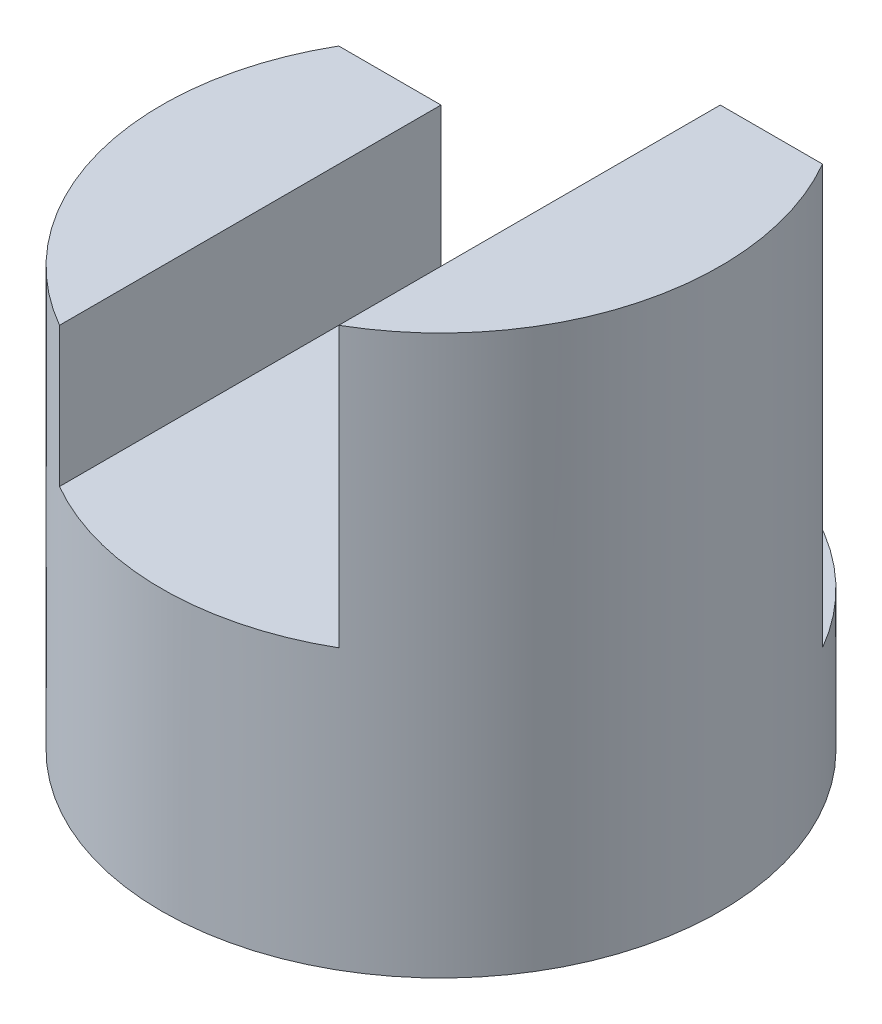
ISO-10303-21;
HEADER;
FILE_DESCRIPTION(('STEP AP214'),'2;1');
FILE_NAME('part.step','',(''),(''),'','','');
FILE_SCHEMA(('AUTOMOTIVE_DESIGN { 1 0 10303 214 1 1 1 1 }'));
ENDSEC;
DATA;
#1=APPLICATION_CONTEXT('core data for automotive mechanical design processes');
#2=APPLICATION_PROTOCOL_DEFINITION('international standard','automotive_design',2000,#1);
#3=PRODUCT_CONTEXT('',#1,'mechanical');
#4=PRODUCT('Part','Part','',(#3));
#5=PRODUCT_RELATED_PRODUCT_CATEGORY('part','',(#4));
#6=PRODUCT_DEFINITION_FORMATION('','',#4);
#7=PRODUCT_DEFINITION_CONTEXT('part definition',#1,'design');
#8=PRODUCT_DEFINITION('design','',#6,#7);
#9=PRODUCT_DEFINITION_SHAPE('','',#8);
#10=(LENGTH_UNIT() NAMED_UNIT(*) SI_UNIT(.MILLI.,.METRE.));
#11=(NAMED_UNIT(*) PLANE_ANGLE_UNIT() SI_UNIT($,.RADIAN.));
#12=(NAMED_UNIT(*) SI_UNIT($,.STERADIAN.) SOLID_ANGLE_UNIT());
#13=UNCERTAINTY_MEASURE_WITH_UNIT(LENGTH_MEASURE(1.E-05),#10,'distance_accuracy_value','');
#14=(GEOMETRIC_REPRESENTATION_CONTEXT(3) GLOBAL_UNCERTAINTY_ASSIGNED_CONTEXT((#13)) GLOBAL_UNIT_ASSIGNED_CONTEXT((#10,
#11,#12)) REPRESENTATION_CONTEXT('',''));
#15=CARTESIAN_POINT('',(0.,0.,0.));
#16=DIRECTION('',(0.,0.,1.));
#17=DIRECTION('',(1.,0.,0.));
#18=AXIS2_PLACEMENT_3D('',#15,#16,#17);
#19=CARTESIAN_POINT('',(0.,4.,0.));
#20=DIRECTION('',(0.,-1.,0.));
#21=DIRECTION('',(0.,0.,-1.));
#22=AXIS2_PLACEMENT_3D('',#19,#20,#21);
#23=CYLINDRICAL_SURFACE('',#22,2.);
#24=CARTESIAN_POINT('',(0.,4.,0.));
#25=DIRECTION('',(0.,1.,0.));
#26=DIRECTION('',(0.,0.,1.));
#27=AXIS2_PLACEMENT_3D('',#24,#25,#26);
#28=CIRCLE('',#27,2.);
#29=CARTESIAN_POINT('',(1.,4.,1.73205080756888));
#30=VERTEX_POINT('',#29);
#31=CARTESIAN_POINT('',(1.73205080756888,4.,-1.));
#32=VERTEX_POINT('',#31);
#33=EDGE_CURVE('E68',#30,#32,#28,.T.);
#34=ORIENTED_EDGE('',*,*,#33,.F.);
#35=DIRECTION('',(0.,-1.,0.));
#36=VECTOR('',#35,1.);
#37=CARTESIAN_POINT('',(1.,4.,1.73205080756888));
#38=LINE('',#37,#36);
#39=CARTESIAN_POINT('',(1.,2.,1.73205080756888));
#40=VERTEX_POINT('',#39);
#41=EDGE_CURVE('E75',#30,#40,#38,.T.);
#42=ORIENTED_EDGE('',*,*,#41,.T.);
#43=CARTESIAN_POINT('',(0.,2.,0.));
#44=DIRECTION('',(0.,-1.,0.));
#45=DIRECTION('',(0.,0.,-1.));
#46=AXIS2_PLACEMENT_3D('',#43,#44,#45);
#47=CIRCLE('',#46,2.);
#48=CARTESIAN_POINT('',(-1.,2.,1.73205080756888));
#49=VERTEX_POINT('',#48);
#50=EDGE_CURVE('E115',#40,#49,#47,.T.);
#51=ORIENTED_EDGE('',*,*,#50,.T.);
#52=DIRECTION('',(0.,-1.,0.));
#53=VECTOR('',#52,1.);
#54=CARTESIAN_POINT('',(-1.,4.,1.73205080756888));
#55=LINE('',#54,#53);
#56=CARTESIAN_POINT('',(-1.,3.,1.73205080756888));
#57=VERTEX_POINT('',#56);
#58=EDGE_CURVE('E102',#49,#57,#55,.F.);
#59=ORIENTED_EDGE('',*,*,#58,.T.);
#60=CARTESIAN_POINT('',(0.,3.,0.));
#61=DIRECTION('',(0.,-1.,0.));
#62=DIRECTION('',(0.,0.,-1.));
#63=AXIS2_PLACEMENT_3D('',#60,#61,#62);
#64=CIRCLE('',#63,2.);
#65=CARTESIAN_POINT('',(-1.73205080756888,3.,-1.));
#66=VERTEX_POINT('',#65);
#67=EDGE_CURVE('E94',#57,#66,#64,.T.);
#68=ORIENTED_EDGE('',*,*,#67,.T.);
#69=DIRECTION('',(0.,1.,0.));
#70=VECTOR('',#69,1.);
#71=CARTESIAN_POINT('',(-1.73205080756888,1.,-1.));
#72=LINE('',#71,#70);
#73=CARTESIAN_POINT('',(-1.73205080756888,1.,-1.));
#74=VERTEX_POINT('',#73);
#75=EDGE_CURVE('E125',#74,#66,#72,.T.);
#76=ORIENTED_EDGE('',*,*,#75,.F.);
#77=CARTESIAN_POINT('',(0.,1.,0.));
#78=DIRECTION('',(0.,1.,0.));
#79=DIRECTION('',(0.,0.,-1.));
#80=AXIS2_PLACEMENT_3D('',#77,#78,#79);
#81=CIRCLE('',#80,2.);
#82=CARTESIAN_POINT('',(1.73205080756888,1.,-1.));
#83=VERTEX_POINT('',#82);
#84=EDGE_CURVE('E121',#83,#74,#81,.T.);
#85=ORIENTED_EDGE('',*,*,#84,.F.);
#86=DIRECTION('',(0.,1.,0.));
#87=VECTOR('',#86,1.);
#88=CARTESIAN_POINT('',(1.73205080756888,1.,-1.));
#89=LINE('',#88,#87);
#90=EDGE_CURVE('E56',#83,#32,#89,.T.);
#91=ORIENTED_EDGE('',*,*,#90,.T.);
#92=EDGE_LOOP('',(#34,#42,#51,#59,#68,#76,#85,#91));
#93=FACE_BOUND('',#92,.T.);
#94=CARTESIAN_POINT('',(0.,0.,0.));
#95=DIRECTION('',(0.,1.,0.));
#96=DIRECTION('',(0.,0.,1.));
#97=AXIS2_PLACEMENT_3D('',#94,#95,#96);
#98=CIRCLE('',#97,2.);
#99=CARTESIAN_POINT('',(0.,0.,2.));
#100=VERTEX_POINT('',#99);
#101=EDGE_CURVE('E128',#100,#100,#98,.T.);
#102=ORIENTED_EDGE('',*,*,#101,.T.);
#103=EDGE_LOOP('',(#102));
#104=FACE_BOUND('',#103,.T.);
#105=ADVANCED_FACE('F33',(#93,#104),#23,.T.);
#106=CARTESIAN_POINT('',(0.,4.,0.));
#107=DIRECTION('',(0.,1.,0.));
#108=DIRECTION('',(0.,0.,1.));
#109=AXIS2_PLACEMENT_3D('',#106,#107,#108);
#110=PLANE('',#109);
#111=DIRECTION('',(0.,0.,1.));
#112=VECTOR('',#111,1.);
#113=CARTESIAN_POINT('',(1.,4.,-5.5));
#114=LINE('',#113,#112);
#115=CARTESIAN_POINT('',(1.,4.,-1.));
#116=VERTEX_POINT('',#115);
#117=EDGE_CURVE('E103',#116,#30,#114,.T.);
#118=ORIENTED_EDGE('',*,*,#117,.T.);
#119=ORIENTED_EDGE('',*,*,#33,.T.);
#120=DIRECTION('',(1.,0.,0.));
#121=VECTOR('',#120,1.);
#122=CARTESIAN_POINT('',(-1.73205080756888,4.,-1.));
#123=LINE('',#122,#121);
#124=EDGE_CURVE('E120',#116,#32,#123,.T.);
#125=ORIENTED_EDGE('',*,*,#124,.F.);
#126=EDGE_LOOP('',(#118,#119,#125));
#127=FACE_BOUND('',#126,.T.);
#128=ADVANCED_FACE('F143',(#127),#110,.T.);
#129=CARTESIAN_POINT('',(0.,0.,0.));
#130=DIRECTION('',(0.,1.,0.));
#131=DIRECTION('',(0.,0.,1.));
#132=AXIS2_PLACEMENT_3D('',#129,#130,#131);
#133=PLANE('',#132);
#134=ORIENTED_EDGE('',*,*,#101,.F.);
#135=EDGE_LOOP('',(#134));
#136=FACE_BOUND('',#135,.T.);
#137=ADVANCED_FACE('F155',(#136),#133,.F.);
#138=CARTESIAN_POINT('',(-1.73205080756888,1.,-1.));
#139=DIRECTION('',(0.,0.,1.));
#140=DIRECTION('',(1.,0.,0.));
#141=AXIS2_PLACEMENT_3D('',#138,#139,#140);
#142=PLANE('',#141);
#143=DIRECTION('',(1.,0.,0.));
#144=VECTOR('',#143,1.);
#145=CARTESIAN_POINT('',(-1.73205080756888,2.,-1.));
#146=LINE('',#145,#144);
#147=CARTESIAN_POINT('',(-1.,2.,-1.));
#148=VERTEX_POINT('',#147);
#149=CARTESIAN_POINT('',(1.,2.,-1.));
#150=VERTEX_POINT('',#149);
#151=EDGE_CURVE('E40',#148,#150,#146,.T.);
#152=ORIENTED_EDGE('',*,*,#151,.T.);
#153=DIRECTION('',(0.,1.,0.));
#154=VECTOR('',#153,1.);
#155=CARTESIAN_POINT('',(1.,1.,-1.));
#156=LINE('',#155,#154);
#157=EDGE_CURVE('E11',#150,#116,#156,.T.);
#158=ORIENTED_EDGE('',*,*,#157,.T.);
#159=ORIENTED_EDGE('',*,*,#124,.T.);
#160=ORIENTED_EDGE('',*,*,#90,.F.);
#161=DIRECTION('',(1.,0.,0.));
#162=VECTOR('',#161,1.);
#163=CARTESIAN_POINT('',(-1.73205080756888,1.,-1.));
#164=LINE('',#163,#162);
#165=EDGE_CURVE('E123',#74,#83,#164,.T.);
#166=ORIENTED_EDGE('',*,*,#165,.F.);
#167=ORIENTED_EDGE('',*,*,#75,.T.);
#168=DIRECTION('',(1.,0.,0.));
#169=VECTOR('',#168,1.);
#170=CARTESIAN_POINT('',(-1.73205080756888,3.,-1.));
#171=LINE('',#170,#169);
#172=CARTESIAN_POINT('',(-1.,3.,-1.));
#173=VERTEX_POINT('',#172);
#174=EDGE_CURVE('E97',#66,#173,#171,.T.);
#175=ORIENTED_EDGE('',*,*,#174,.T.);
#176=DIRECTION('',(0.,-1.,0.));
#177=VECTOR('',#176,1.);
#178=CARTESIAN_POINT('',(-1.,1.,-1.));
#179=LINE('',#178,#177);
#180=EDGE_CURVE('E110',#173,#148,#179,.T.);
#181=ORIENTED_EDGE('',*,*,#180,.T.);
#182=EDGE_LOOP('',(#152,#158,#159,#160,#166,#167,#175,#181));
#183=FACE_BOUND('',#182,.T.);
#184=ADVANCED_FACE('F135',(#183),#142,.F.);
#185=CARTESIAN_POINT('',(0.,1.,0.));
#186=DIRECTION('',(0.,-1.,0.));
#187=DIRECTION('',(0.,0.,-1.));
#188=AXIS2_PLACEMENT_3D('',#185,#186,#187);
#189=PLANE('',#188);
#190=ORIENTED_EDGE('',*,*,#84,.T.);
#191=ORIENTED_EDGE('',*,*,#165,.T.);
#192=EDGE_LOOP('',(#190,#191));
#193=FACE_BOUND('',#192,.T.);
#194=ADVANCED_FACE('F146',(#193),#189,.F.);
#195=CARTESIAN_POINT('',(1.,2.,-5.5));
#196=DIRECTION('',(1.,0.,0.));
#197=DIRECTION('',(0.,0.,-1.));
#198=AXIS2_PLACEMENT_3D('',#195,#196,#197);
#199=PLANE('',#198);
#200=ORIENTED_EDGE('',*,*,#117,.F.);
#201=ORIENTED_EDGE('',*,*,#157,.F.);
#202=DIRECTION('',(0.,0.,1.));
#203=VECTOR('',#202,1.);
#204=CARTESIAN_POINT('',(1.,2.,-5.5));
#205=LINE('',#204,#203);
#206=EDGE_CURVE('E139',#150,#40,#205,.T.);
#207=ORIENTED_EDGE('',*,*,#206,.T.);
#208=ORIENTED_EDGE('',*,*,#41,.F.);
#209=EDGE_LOOP('',(#200,#201,#207,#208));
#210=FACE_BOUND('',#209,.T.);
#211=ADVANCED_FACE('F148',(#210),#199,.F.);
#212=CARTESIAN_POINT('',(-1.,2.,-5.5));
#213=DIRECTION('',(0.,-1.,0.));
#214=DIRECTION('',(0.,0.,-1.));
#215=AXIS2_PLACEMENT_3D('',#212,#213,#214);
#216=PLANE('',#215);
#217=ORIENTED_EDGE('',*,*,#206,.F.);
#218=ORIENTED_EDGE('',*,*,#151,.F.);
#219=DIRECTION('',(0.,0.,1.));
#220=VECTOR('',#219,1.);
#221=CARTESIAN_POINT('',(-1.,2.,-5.5));
#222=LINE('',#221,#220);
#223=EDGE_CURVE('E111',#148,#49,#222,.T.);
#224=ORIENTED_EDGE('',*,*,#223,.T.);
#225=ORIENTED_EDGE('',*,*,#50,.F.);
#226=EDGE_LOOP('',(#217,#218,#224,#225));
#227=FACE_BOUND('',#226,.T.);
#228=ADVANCED_FACE('F138',(#227),#216,.F.);
#229=CARTESIAN_POINT('',(-1.,3.,-5.5));
#230=DIRECTION('',(-1.,0.,0.));
#231=DIRECTION('',(0.,0.,1.));
#232=AXIS2_PLACEMENT_3D('',#229,#230,#231);
#233=PLANE('',#232);
#234=ORIENTED_EDGE('',*,*,#223,.F.);
#235=ORIENTED_EDGE('',*,*,#180,.F.);
#236=DIRECTION('',(0.,0.,1.));
#237=VECTOR('',#236,1.);
#238=CARTESIAN_POINT('',(-1.,3.,-5.5));
#239=LINE('',#238,#237);
#240=EDGE_CURVE('E47',#173,#57,#239,.T.);
#241=ORIENTED_EDGE('',*,*,#240,.T.);
#242=ORIENTED_EDGE('',*,*,#58,.F.);
#243=EDGE_LOOP('',(#234,#235,#241,#242));
#244=FACE_BOUND('',#243,.T.);
#245=ADVANCED_FACE('F107',(#244),#233,.F.);
#246=CARTESIAN_POINT('',(-2.,3.,-5.5));
#247=DIRECTION('',(0.,-1.,0.));
#248=DIRECTION('',(0.,0.,-1.));
#249=AXIS2_PLACEMENT_3D('',#246,#247,#248);
#250=PLANE('',#249);
#251=ORIENTED_EDGE('',*,*,#240,.F.);
#252=ORIENTED_EDGE('',*,*,#174,.F.);
#253=ORIENTED_EDGE('',*,*,#67,.F.);
#254=EDGE_LOOP('',(#251,#252,#253));
#255=FACE_BOUND('',#254,.T.);
#256=ADVANCED_FACE('F95',(#255),#250,.F.);
#257=CLOSED_SHELL('',(#105,#128,#137,#184,#194,#211,#228,#245,#256));
#258=MANIFOLD_SOLID_BREP('B2',#257);
#259=ADVANCED_BREP_SHAPE_REPRESENTATION('',(#18,#258),#14);
#260=SHAPE_DEFINITION_REPRESENTATION(#9,#259);
ENDSEC;
END-ISO-10303-21;
